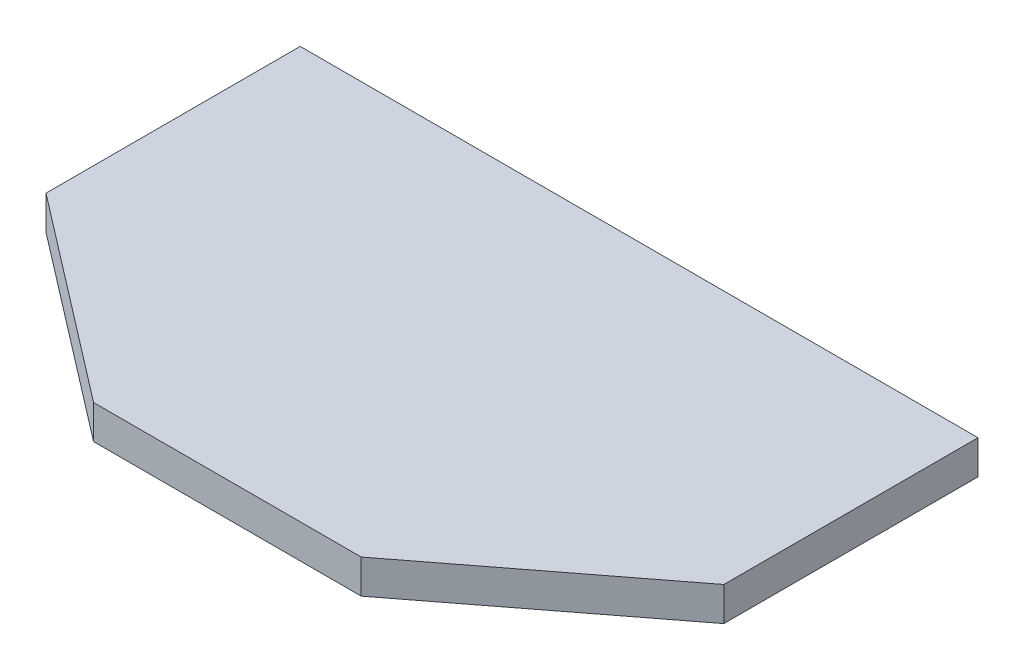
ISO-10303-21;
HEADER;
FILE_DESCRIPTION(('STEP AP214'),'2;1');
FILE_NAME('part.step','',(''),(''),'','','');
FILE_SCHEMA(('AUTOMOTIVE_DESIGN { 1 0 10303 214 1 1 1 1 }'));
ENDSEC;
DATA;
#1=APPLICATION_CONTEXT('core data for automotive mechanical design processes');
#2=APPLICATION_PROTOCOL_DEFINITION('international standard','automotive_design',2000,#1);
#3=PRODUCT_CONTEXT('',#1,'mechanical');
#4=PRODUCT('Part','Part','',(#3));
#5=PRODUCT_RELATED_PRODUCT_CATEGORY('part','',(#4));
#6=PRODUCT_DEFINITION_FORMATION('','',#4);
#7=PRODUCT_DEFINITION_CONTEXT('part definition',#1,'design');
#8=PRODUCT_DEFINITION('design','',#6,#7);
#9=PRODUCT_DEFINITION_SHAPE('','',#8);
#10=(LENGTH_UNIT() NAMED_UNIT(*) SI_UNIT(.MILLI.,.METRE.));
#11=(NAMED_UNIT(*) PLANE_ANGLE_UNIT() SI_UNIT($,.RADIAN.));
#12=(NAMED_UNIT(*) SI_UNIT($,.STERADIAN.) SOLID_ANGLE_UNIT());
#13=UNCERTAINTY_MEASURE_WITH_UNIT(LENGTH_MEASURE(1.E-05),#10,'distance_accuracy_value','');
#14=(GEOMETRIC_REPRESENTATION_CONTEXT(3) GLOBAL_UNCERTAINTY_ASSIGNED_CONTEXT((#13)) GLOBAL_UNIT_ASSIGNED_CONTEXT((#10,
#11,#12)) REPRESENTATION_CONTEXT('',''));
#15=CARTESIAN_POINT('',(0.,0.,0.));
#16=DIRECTION('',(0.,0.,1.));
#17=DIRECTION('',(1.,0.,0.));
#18=AXIS2_PLACEMENT_3D('',#15,#16,#17);
#19=CARTESIAN_POINT('',(0.,-2.54,0.));
#20=DIRECTION('',(0.,0.,1.));
#21=DIRECTION('',(1.,0.,0.));
#22=AXIS2_PLACEMENT_3D('',#19,#20,#21);
#23=PLANE('',#22);
#24=DIRECTION('',(1.,0.,0.));
#25=VECTOR('',#24,1.);
#26=CARTESIAN_POINT('',(0.,0.,0.));
#27=LINE('',#26,#25);
#28=CARTESIAN_POINT('',(-10.0295864892137,0.,0.));
#29=VERTEX_POINT('',#28);
#30=CARTESIAN_POINT('',(10.0295864892137,0.,0.));
#31=VERTEX_POINT('',#30);
#32=EDGE_CURVE('E131',#29,#31,#27,.T.);
#33=ORIENTED_EDGE('',*,*,#32,.F.);
#34=DIRECTION('',(0.,1.,0.));
#35=VECTOR('',#34,1.);
#36=CARTESIAN_POINT('',(-10.0295864892137,-2.54,0.));
#37=LINE('',#36,#35);
#38=CARTESIAN_POINT('',(-10.0295864892137,-2.54,0.));
#39=VERTEX_POINT('',#38);
#40=EDGE_CURVE('E11',#39,#29,#37,.T.);
#41=ORIENTED_EDGE('',*,*,#40,.F.);
#42=DIRECTION('',(1.,0.,0.));
#43=VECTOR('',#42,1.);
#44=CARTESIAN_POINT('',(0.,-2.54,0.));
#45=LINE('',#44,#43);
#46=CARTESIAN_POINT('',(10.0295864892137,-2.54,0.));
#47=VERTEX_POINT('',#46);
#48=EDGE_CURVE('E52',#39,#47,#45,.T.);
#49=ORIENTED_EDGE('',*,*,#48,.T.);
#50=DIRECTION('',(0.,1.,0.));
#51=VECTOR('',#50,1.);
#52=CARTESIAN_POINT('',(10.0295864892137,-2.54,0.));
#53=LINE('',#52,#51);
#54=EDGE_CURVE('E37',#47,#31,#53,.T.);
#55=ORIENTED_EDGE('',*,*,#54,.T.);
#56=EDGE_LOOP('',(#33,#41,#49,#55));
#57=FACE_BOUND('',#56,.T.);
#58=ADVANCED_FACE('F33',(#57),#23,.T.);
#59=CARTESIAN_POINT('',(-25.4,-2.54,-11.8060486788735));
#60=DIRECTION('',(-0.609148317257031,0.,0.793056320561741));
#61=DIRECTION('',(0.793056320561741,0.,0.609148317257031));
#62=AXIS2_PLACEMENT_3D('',#59,#60,#61);
#63=PLANE('',#62);
#64=DIRECTION('',(0.793056320561741,0.,0.609148317257031));
#65=VECTOR('',#64,1.);
#66=CARTESIAN_POINT('',(-25.4,0.,-11.8060486788735));
#67=LINE('',#66,#65);
#68=CARTESIAN_POINT('',(-25.4,0.,-11.8060486788735));
#69=VERTEX_POINT('',#68);
#70=EDGE_CURVE('E129',#69,#29,#67,.T.);
#71=ORIENTED_EDGE('',*,*,#70,.F.);
#72=DIRECTION('',(0.,1.,0.));
#73=VECTOR('',#72,1.);
#74=CARTESIAN_POINT('',(-25.4,-2.54,-11.8060486788735));
#75=LINE('',#74,#73);
#76=CARTESIAN_POINT('',(-25.4,-2.54,-11.8060486788735));
#77=VERTEX_POINT('',#76);
#78=EDGE_CURVE('E43',#77,#69,#75,.T.);
#79=ORIENTED_EDGE('',*,*,#78,.F.);
#80=DIRECTION('',(0.793056320561741,0.,0.609148317257031));
#81=VECTOR('',#80,1.);
#82=CARTESIAN_POINT('',(-25.4,-2.54,-11.8060486788735));
#83=LINE('',#82,#81);
#84=EDGE_CURVE('E109',#77,#39,#83,.T.);
#85=ORIENTED_EDGE('',*,*,#84,.T.);
#86=ORIENTED_EDGE('',*,*,#40,.T.);
#87=EDGE_LOOP('',(#71,#79,#85,#86));
#88=FACE_BOUND('',#87,.T.);
#89=ADVANCED_FACE('F140',(#88),#63,.T.);
#90=CARTESIAN_POINT('',(-25.4,-2.54,-19.05));
#91=DIRECTION('',(-1.,0.,0.));
#92=DIRECTION('',(0.,0.,1.));
#93=AXIS2_PLACEMENT_3D('',#90,#91,#92);
#94=PLANE('',#93);
#95=DIRECTION('',(0.,0.,1.));
#96=VECTOR('',#95,1.);
#97=CARTESIAN_POINT('',(-25.4,0.,-19.05));
#98=LINE('',#97,#96);
#99=CARTESIAN_POINT('',(-25.4,0.,-30.8560486788735));
#100=VERTEX_POINT('',#99);
#101=EDGE_CURVE('E98',#100,#69,#98,.T.);
#102=ORIENTED_EDGE('',*,*,#101,.F.);
#103=DIRECTION('',(0.,1.,0.));
#104=VECTOR('',#103,1.);
#105=CARTESIAN_POINT('',(-25.4,-2.54,-30.8560486788735));
#106=LINE('',#105,#104);
#107=CARTESIAN_POINT('',(-25.4,-2.54,-30.8560486788735));
#108=VERTEX_POINT('',#107);
#109=EDGE_CURVE('E93',#108,#100,#106,.T.);
#110=ORIENTED_EDGE('',*,*,#109,.F.);
#111=DIRECTION('',(0.,0.,1.));
#112=VECTOR('',#111,1.);
#113=CARTESIAN_POINT('',(-25.4,-2.54,-19.05));
#114=LINE('',#113,#112);
#115=EDGE_CURVE('E96',#108,#77,#114,.T.);
#116=ORIENTED_EDGE('',*,*,#115,.T.);
#117=ORIENTED_EDGE('',*,*,#78,.T.);
#118=EDGE_LOOP('',(#102,#110,#116,#117));
#119=FACE_BOUND('',#118,.T.);
#120=ADVANCED_FACE('F95',(#119),#94,.T.);
#121=CARTESIAN_POINT('',(-25.4,-2.54,-30.8560486788735));
#122=DIRECTION('',(0.,0.,-1.));
#123=DIRECTION('',(-1.,0.,0.));
#124=AXIS2_PLACEMENT_3D('',#121,#122,#123);
#125=PLANE('',#124);
#126=DIRECTION('',(-1.,0.,0.));
#127=VECTOR('',#126,1.);
#128=CARTESIAN_POINT('',(-25.4,0.,-30.8560486788735));
#129=LINE('',#128,#127);
#130=CARTESIAN_POINT('',(25.4,0.,-30.8560486788735));
#131=VERTEX_POINT('',#130);
#132=EDGE_CURVE('E126',#131,#100,#129,.T.);
#133=ORIENTED_EDGE('',*,*,#132,.F.);
#134=DIRECTION('',(0.,1.,0.));
#135=VECTOR('',#134,1.);
#136=CARTESIAN_POINT('',(25.4,-2.54,-30.8560486788735));
#137=LINE('',#136,#135);
#138=CARTESIAN_POINT('',(25.4,-2.54,-30.8560486788735));
#139=VERTEX_POINT('',#138);
#140=EDGE_CURVE('E103',#139,#131,#137,.T.);
#141=ORIENTED_EDGE('',*,*,#140,.F.);
#142=DIRECTION('',(-1.,0.,0.));
#143=VECTOR('',#142,1.);
#144=CARTESIAN_POINT('',(-25.4,-2.54,-30.8560486788735));
#145=LINE('',#144,#143);
#146=EDGE_CURVE('E108',#139,#108,#145,.T.);
#147=ORIENTED_EDGE('',*,*,#146,.T.);
#148=ORIENTED_EDGE('',*,*,#109,.T.);
#149=EDGE_LOOP('',(#133,#141,#147,#148));
#150=FACE_BOUND('',#149,.T.);
#151=ADVANCED_FACE('F112',(#150),#125,.T.);
#152=CARTESIAN_POINT('',(25.4,-2.54,-30.8560486788735));
#153=DIRECTION('',(1.,0.,0.));
#154=DIRECTION('',(0.,0.,-1.));
#155=AXIS2_PLACEMENT_3D('',#152,#153,#154);
#156=PLANE('',#155);
#157=DIRECTION('',(0.,0.,-1.));
#158=VECTOR('',#157,1.);
#159=CARTESIAN_POINT('',(25.4,0.,-30.8560486788735));
#160=LINE('',#159,#158);
#161=CARTESIAN_POINT('',(25.4,0.,-11.8060486788735));
#162=VERTEX_POINT('',#161);
#163=EDGE_CURVE('E123',#162,#131,#160,.T.);
#164=ORIENTED_EDGE('',*,*,#163,.F.);
#165=DIRECTION('',(0.,1.,0.));
#166=VECTOR('',#165,1.);
#167=CARTESIAN_POINT('',(25.4,-2.54,-11.8060486788735));
#168=LINE('',#167,#166);
#169=CARTESIAN_POINT('',(25.4,-2.54,-11.8060486788735));
#170=VERTEX_POINT('',#169);
#171=EDGE_CURVE('E134',#170,#162,#168,.T.);
#172=ORIENTED_EDGE('',*,*,#171,.F.);
#173=DIRECTION('',(0.,0.,-1.));
#174=VECTOR('',#173,1.);
#175=CARTESIAN_POINT('',(25.4,-2.54,-19.05));
#176=LINE('',#175,#174);
#177=EDGE_CURVE('E113',#170,#139,#176,.T.);
#178=ORIENTED_EDGE('',*,*,#177,.T.);
#179=ORIENTED_EDGE('',*,*,#140,.T.);
#180=EDGE_LOOP('',(#164,#172,#178,#179));
#181=FACE_BOUND('',#180,.T.);
#182=ADVANCED_FACE('F152',(#181),#156,.T.);
#183=CARTESIAN_POINT('',(25.4,-2.54,-11.8060486788735));
#184=DIRECTION('',(0.609148317257031,0.,0.793056320561741));
#185=DIRECTION('',(0.793056320561741,0.,-0.609148317257031));
#186=AXIS2_PLACEMENT_3D('',#183,#184,#185);
#187=PLANE('',#186);
#188=DIRECTION('',(0.793056320561741,0.,-0.609148317257031));
#189=VECTOR('',#188,1.);
#190=CARTESIAN_POINT('',(25.4,0.,-11.8060486788735));
#191=LINE('',#190,#189);
#192=EDGE_CURVE('E120',#31,#162,#191,.T.);
#193=ORIENTED_EDGE('',*,*,#192,.F.);
#194=ORIENTED_EDGE('',*,*,#54,.F.);
#195=DIRECTION('',(0.793056320561741,0.,-0.609148317257031));
#196=VECTOR('',#195,1.);
#197=CARTESIAN_POINT('',(25.4,-2.54,-11.8060486788735));
#198=LINE('',#197,#196);
#199=EDGE_CURVE('E115',#47,#170,#198,.T.);
#200=ORIENTED_EDGE('',*,*,#199,.T.);
#201=ORIENTED_EDGE('',*,*,#171,.T.);
#202=EDGE_LOOP('',(#193,#194,#200,#201));
#203=FACE_BOUND('',#202,.T.);
#204=ADVANCED_FACE('F35',(#203),#187,.T.);
#205=CARTESIAN_POINT('',(0.,-2.54,0.));
#206=DIRECTION('',(0.,-1.,0.));
#207=DIRECTION('',(0.,0.,-1.));
#208=AXIS2_PLACEMENT_3D('',#205,#206,#207);
#209=PLANE('',#208);
#210=ORIENTED_EDGE('',*,*,#48,.F.);
#211=ORIENTED_EDGE('',*,*,#84,.F.);
#212=ORIENTED_EDGE('',*,*,#115,.F.);
#213=ORIENTED_EDGE('',*,*,#146,.F.);
#214=ORIENTED_EDGE('',*,*,#177,.F.);
#215=ORIENTED_EDGE('',*,*,#199,.F.);
#216=EDGE_LOOP('',(#210,#211,#212,#213,#214,#215));
#217=FACE_BOUND('',#216,.T.);
#218=ADVANCED_FACE('F106',(#217),#209,.T.);
#219=CARTESIAN_POINT('',(0.,0.,0.));
#220=DIRECTION('',(0.,-1.,0.));
#221=DIRECTION('',(0.,0.,-1.));
#222=AXIS2_PLACEMENT_3D('',#219,#220,#221);
#223=PLANE('',#222);
#224=ORIENTED_EDGE('',*,*,#32,.T.);
#225=ORIENTED_EDGE('',*,*,#192,.T.);
#226=ORIENTED_EDGE('',*,*,#163,.T.);
#227=ORIENTED_EDGE('',*,*,#132,.T.);
#228=ORIENTED_EDGE('',*,*,#101,.T.);
#229=ORIENTED_EDGE('',*,*,#70,.T.);
#230=EDGE_LOOP('',(#224,#225,#226,#227,#228,#229));
#231=FACE_BOUND('',#230,.T.);
#232=ADVANCED_FACE('F139',(#231),#223,.F.);
#233=CLOSED_SHELL('',(#58,#89,#120,#151,#182,#204,#218,#232));
#234=MANIFOLD_SOLID_BREP('B2',#233);
#235=ADVANCED_BREP_SHAPE_REPRESENTATION('',(#18,#234),#14);
#236=SHAPE_DEFINITION_REPRESENTATION(#9,#235);
ENDSEC;
END-ISO-10303-21;
